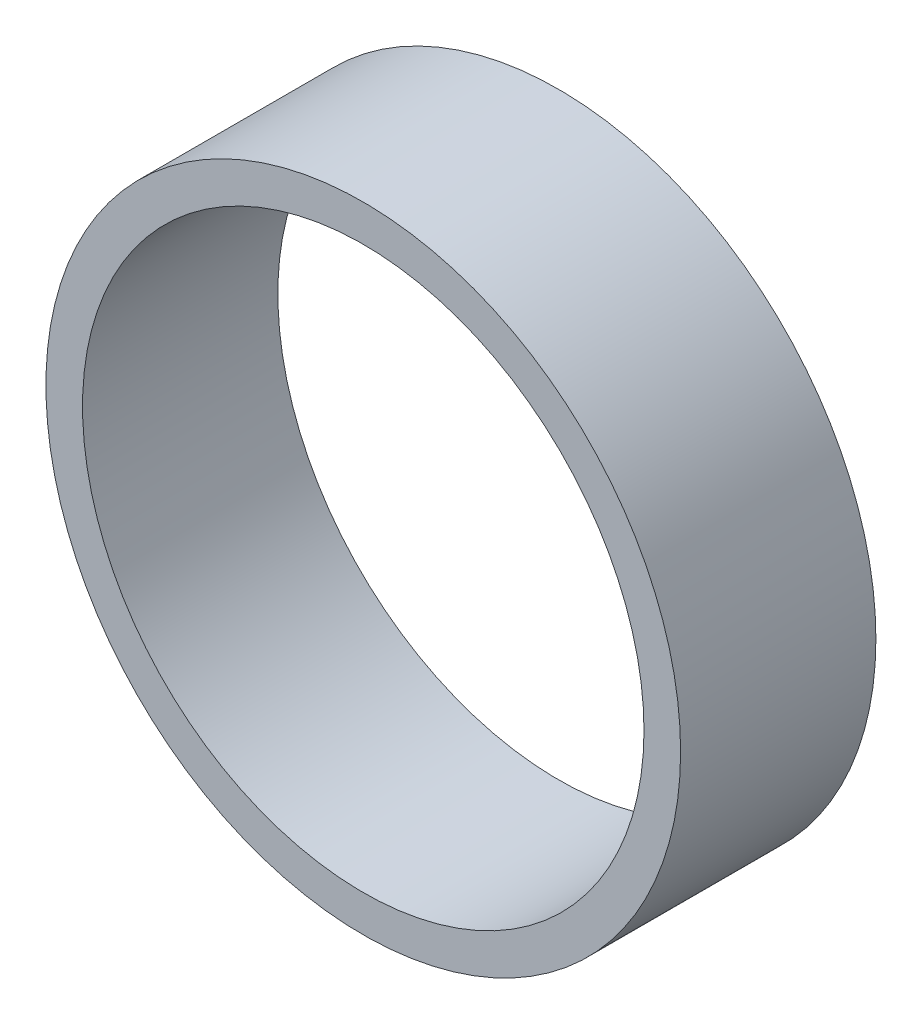
ISO-10303-21;
HEADER;
FILE_DESCRIPTION(('STEP AP214'),'2;1');
FILE_NAME('part.step','',(''),(''),'','','');
FILE_SCHEMA(('AUTOMOTIVE_DESIGN { 1 0 10303 214 1 1 1 1 }'));
ENDSEC;
DATA;
#1=APPLICATION_CONTEXT('core data for automotive mechanical design processes');
#2=APPLICATION_PROTOCOL_DEFINITION('international standard','automotive_design',2000,#1);
#3=PRODUCT_CONTEXT('',#1,'mechanical');
#4=PRODUCT('Part','Part','',(#3));
#5=PRODUCT_RELATED_PRODUCT_CATEGORY('part','',(#4));
#6=PRODUCT_DEFINITION_FORMATION('','',#4);
#7=PRODUCT_DEFINITION_CONTEXT('part definition',#1,'design');
#8=PRODUCT_DEFINITION('design','',#6,#7);
#9=PRODUCT_DEFINITION_SHAPE('','',#8);
#10=(LENGTH_UNIT() NAMED_UNIT(*) SI_UNIT(.MILLI.,.METRE.));
#11=(NAMED_UNIT(*) PLANE_ANGLE_UNIT() SI_UNIT($,.RADIAN.));
#12=(NAMED_UNIT(*) SI_UNIT($,.STERADIAN.) SOLID_ANGLE_UNIT());
#13=UNCERTAINTY_MEASURE_WITH_UNIT(LENGTH_MEASURE(1.E-05),#10,'distance_accuracy_value','');
#14=(GEOMETRIC_REPRESENTATION_CONTEXT(3) GLOBAL_UNCERTAINTY_ASSIGNED_CONTEXT((#13)) GLOBAL_UNIT_ASSIGNED_CONTEXT((#10,
#11,#12)) REPRESENTATION_CONTEXT('',''));
#15=CARTESIAN_POINT('',(0.,0.,0.));
#16=DIRECTION('',(0.,0.,1.));
#17=DIRECTION('',(1.,0.,0.));
#18=AXIS2_PLACEMENT_3D('',#15,#16,#17);
#19=CARTESIAN_POINT('',(0.,0.,8.));
#20=DIRECTION('',(0.,0.,1.));
#21=DIRECTION('',(1.,0.,0.));
#22=AXIS2_PLACEMENT_3D('',#19,#20,#21);
#23=PLANE('',#22);
#24=CARTESIAN_POINT('',(0.,0.,8.));
#25=DIRECTION('',(0.,0.,1.));
#26=DIRECTION('',(1.,0.,0.));
#27=AXIS2_PLACEMENT_3D('',#24,#25,#26);
#28=CIRCLE('',#27,13.);
#29=CARTESIAN_POINT('',(13.,0.,8.));
#30=VERTEX_POINT('',#29);
#31=EDGE_CURVE('E11',#30,#30,#28,.T.);
#32=ORIENTED_EDGE('',*,*,#31,.T.);
#33=EDGE_LOOP('',(#32));
#34=FACE_BOUND('',#33,.T.);
#35=CARTESIAN_POINT('',(0.,0.,8.));
#36=DIRECTION('',(0.,0.,1.));
#37=DIRECTION('',(1.,0.,0.));
#38=AXIS2_PLACEMENT_3D('',#35,#36,#37);
#39=CIRCLE('',#38,11.5);
#40=CARTESIAN_POINT('',(11.5,0.,8.));
#41=VERTEX_POINT('',#40);
#42=EDGE_CURVE('E51',#41,#41,#39,.T.);
#43=ORIENTED_EDGE('',*,*,#42,.F.);
#44=EDGE_LOOP('',(#43));
#45=FACE_BOUND('',#44,.T.);
#46=ADVANCED_FACE('F40',(#34,#45),#23,.T.);
#47=CARTESIAN_POINT('',(0.,0.,0.));
#48=DIRECTION('',(0.,0.,1.));
#49=DIRECTION('',(1.,0.,0.));
#50=AXIS2_PLACEMENT_3D('',#47,#48,#49);
#51=PLANE('',#50);
#52=CARTESIAN_POINT('',(0.,0.,0.));
#53=DIRECTION('',(0.,0.,1.));
#54=DIRECTION('',(1.,0.,0.));
#55=AXIS2_PLACEMENT_3D('',#52,#53,#54);
#56=CIRCLE('',#55,13.);
#57=CARTESIAN_POINT('',(13.,0.,0.));
#58=VERTEX_POINT('',#57);
#59=EDGE_CURVE('E44',#58,#58,#56,.T.);
#60=ORIENTED_EDGE('',*,*,#59,.F.);
#61=EDGE_LOOP('',(#60));
#62=FACE_BOUND('',#61,.T.);
#63=CARTESIAN_POINT('',(0.,0.,0.));
#64=DIRECTION('',(0.,0.,1.));
#65=DIRECTION('',(1.,0.,0.));
#66=AXIS2_PLACEMENT_3D('',#63,#64,#65);
#67=CIRCLE('',#66,11.5);
#68=CARTESIAN_POINT('',(11.5,0.,0.));
#69=VERTEX_POINT('',#68);
#70=EDGE_CURVE('E53',#69,#69,#67,.T.);
#71=ORIENTED_EDGE('',*,*,#70,.T.);
#72=EDGE_LOOP('',(#71));
#73=FACE_BOUND('',#72,.T.);
#74=ADVANCED_FACE('F63',(#62,#73),#51,.F.);
#75=CARTESIAN_POINT('',(0.,0.,8.));
#76=DIRECTION('',(0.,0.,-1.));
#77=DIRECTION('',(-1.,0.,0.));
#78=AXIS2_PLACEMENT_3D('',#75,#76,#77);
#79=CYLINDRICAL_SURFACE('',#78,13.);
#80=ORIENTED_EDGE('',*,*,#31,.F.);
#81=EDGE_LOOP('',(#80));
#82=FACE_BOUND('',#81,.T.);
#83=ORIENTED_EDGE('',*,*,#59,.T.);
#84=EDGE_LOOP('',(#83));
#85=FACE_BOUND('',#84,.T.);
#86=ADVANCED_FACE('F42',(#82,#85),#79,.T.);
#87=CARTESIAN_POINT('',(0.,0.,8.));
#88=DIRECTION('',(0.,0.,-1.));
#89=DIRECTION('',(-1.,0.,0.));
#90=AXIS2_PLACEMENT_3D('',#87,#88,#89);
#91=CYLINDRICAL_SURFACE('',#90,11.5);
#92=ORIENTED_EDGE('',*,*,#42,.T.);
#93=EDGE_LOOP('',(#92));
#94=FACE_BOUND('',#93,.T.);
#95=ORIENTED_EDGE('',*,*,#70,.F.);
#96=EDGE_LOOP('',(#95));
#97=FACE_BOUND('',#96,.T.);
#98=ADVANCED_FACE('F59',(#94,#97),#91,.F.);
#99=CLOSED_SHELL('',(#46,#74,#86,#98));
#100=MANIFOLD_SOLID_BREP('B2',#99);
#101=ADVANCED_BREP_SHAPE_REPRESENTATION('',(#18,#100),#14);
#102=SHAPE_DEFINITION_REPRESENTATION(#9,#101);
ENDSEC;
END-ISO-10303-21;
